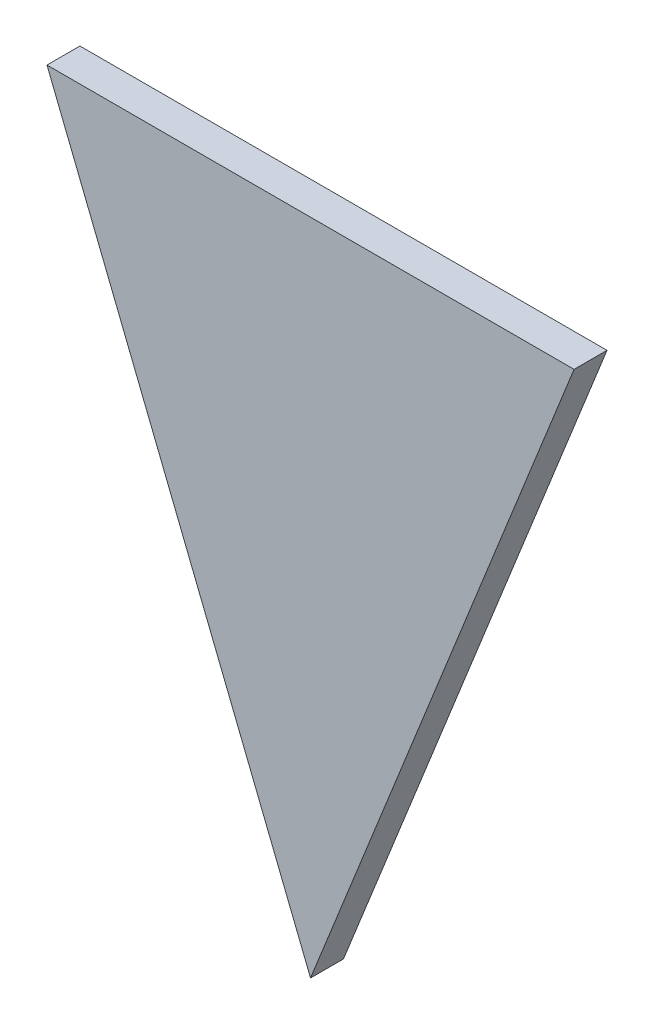
ISO-10303-21;
HEADER;
FILE_DESCRIPTION(('STEP AP214'),'2;1');
FILE_NAME('part.step','',(''),(''),'','','');
FILE_SCHEMA(('AUTOMOTIVE_DESIGN { 1 0 10303 214 1 1 1 1 }'));
ENDSEC;
DATA;
#1=APPLICATION_CONTEXT('core data for automotive mechanical design processes');
#2=APPLICATION_PROTOCOL_DEFINITION('international standard','automotive_design',2000,#1);
#3=PRODUCT_CONTEXT('',#1,'mechanical');
#4=PRODUCT('Part','Part','',(#3));
#5=PRODUCT_RELATED_PRODUCT_CATEGORY('part','',(#4));
#6=PRODUCT_DEFINITION_FORMATION('','',#4);
#7=PRODUCT_DEFINITION_CONTEXT('part definition',#1,'design');
#8=PRODUCT_DEFINITION('design','',#6,#7);
#9=PRODUCT_DEFINITION_SHAPE('','',#8);
#10=(LENGTH_UNIT() NAMED_UNIT(*) SI_UNIT(.MILLI.,.METRE.));
#11=(NAMED_UNIT(*) PLANE_ANGLE_UNIT() SI_UNIT($,.RADIAN.));
#12=(NAMED_UNIT(*) SI_UNIT($,.STERADIAN.) SOLID_ANGLE_UNIT());
#13=UNCERTAINTY_MEASURE_WITH_UNIT(LENGTH_MEASURE(1.E-05),#10,'distance_accuracy_value','');
#14=(GEOMETRIC_REPRESENTATION_CONTEXT(3) GLOBAL_UNCERTAINTY_ASSIGNED_CONTEXT((#13)) GLOBAL_UNIT_ASSIGNED_CONTEXT((#10,
#11,#12)) REPRESENTATION_CONTEXT('',''));
#15=CARTESIAN_POINT('',(0.,0.,0.));
#16=DIRECTION('',(0.,0.,1.));
#17=DIRECTION('',(1.,0.,0.));
#18=AXIS2_PLACEMENT_3D('',#15,#16,#17);
#19=CARTESIAN_POINT('',(0.,0.,0.));
#20=DIRECTION('',(0.,0.,1.));
#21=DIRECTION('',(1.,0.,0.));
#22=AXIS2_PLACEMENT_3D('',#19,#20,#21);
#23=PLANE('',#22);
#24=DIRECTION('',(-1.,0.,0.));
#25=VECTOR('',#24,1.);
#26=CARTESIAN_POINT('',(1.016,3.048,0.));
#27=LINE('',#26,#25);
#28=CARTESIAN_POINT('',(1.016,3.048,0.));
#29=VERTEX_POINT('',#28);
#30=CARTESIAN_POINT('',(-1.016,3.048,0.));
#31=VERTEX_POINT('',#30);
#32=EDGE_CURVE('E11',#29,#31,#27,.T.);
#33=ORIENTED_EDGE('',*,*,#32,.F.);
#34=DIRECTION('',(0.371390676354104,0.928476690885259,0.));
#35=VECTOR('',#34,1.);
#36=CARTESIAN_POINT('',(0.,0.508,0.));
#37=LINE('',#36,#35);
#38=CARTESIAN_POINT('',(0.,0.508,0.));
#39=VERTEX_POINT('',#38);
#40=EDGE_CURVE('E25',#39,#29,#37,.T.);
#41=ORIENTED_EDGE('',*,*,#40,.F.);
#42=DIRECTION('',(0.371390676354104,-0.928476690885259,0.));
#43=VECTOR('',#42,1.);
#44=CARTESIAN_POINT('',(-1.016,3.048,0.));
#45=LINE('',#44,#43);
#46=EDGE_CURVE('E82',#31,#39,#45,.T.);
#47=ORIENTED_EDGE('',*,*,#46,.F.);
#48=EDGE_LOOP('',(#33,#41,#47));
#49=FACE_BOUND('',#48,.T.);
#50=ADVANCED_FACE('F17',(#49),#23,.F.);
#51=CARTESIAN_POINT('',(-1.016,3.048,0.127));
#52=DIRECTION('',(0.928476690885259,0.371390676354104,0.));
#53=DIRECTION('',(-0.371390676354104,0.928476690885259,0.));
#54=AXIS2_PLACEMENT_3D('',#51,#52,#53);
#55=PLANE('',#54);
#56=ORIENTED_EDGE('',*,*,#46,.T.);
#57=DIRECTION('',(0.,0.,-1.));
#58=VECTOR('',#57,1.);
#59=CARTESIAN_POINT('',(0.,0.508,0.127));
#60=LINE('',#59,#58);
#61=CARTESIAN_POINT('',(0.,0.508,0.127));
#62=VERTEX_POINT('',#61);
#63=EDGE_CURVE('E78',#62,#39,#60,.T.);
#64=ORIENTED_EDGE('',*,*,#63,.F.);
#65=DIRECTION('',(0.371390676354104,-0.928476690885259,0.));
#66=VECTOR('',#65,1.);
#67=CARTESIAN_POINT('',(-1.016,3.048,0.127));
#68=LINE('',#67,#66);
#69=CARTESIAN_POINT('',(-1.016,3.048,0.127));
#70=VERTEX_POINT('',#69);
#71=EDGE_CURVE('E65',#70,#62,#68,.T.);
#72=ORIENTED_EDGE('',*,*,#71,.F.);
#73=DIRECTION('',(0.,0.,-1.));
#74=VECTOR('',#73,1.);
#75=CARTESIAN_POINT('',(-1.016,3.048,0.127));
#76=LINE('',#75,#74);
#77=EDGE_CURVE('E53',#70,#31,#76,.T.);
#78=ORIENTED_EDGE('',*,*,#77,.T.);
#79=EDGE_LOOP('',(#56,#64,#72,#78));
#80=FACE_BOUND('',#79,.T.);
#81=ADVANCED_FACE('F91',(#80),#55,.F.);
#82=CARTESIAN_POINT('',(1.016,3.048,0.127));
#83=DIRECTION('',(0.,-1.,0.));
#84=DIRECTION('',(0.,0.,-1.));
#85=AXIS2_PLACEMENT_3D('',#82,#83,#84);
#86=PLANE('',#85);
#87=ORIENTED_EDGE('',*,*,#32,.T.);
#88=ORIENTED_EDGE('',*,*,#77,.F.);
#89=DIRECTION('',(-1.,0.,0.));
#90=VECTOR('',#89,1.);
#91=CARTESIAN_POINT('',(1.016,3.048,0.127));
#92=LINE('',#91,#90);
#93=CARTESIAN_POINT('',(1.016,3.048,0.127));
#94=VERTEX_POINT('',#93);
#95=EDGE_CURVE('E48',#94,#70,#92,.T.);
#96=ORIENTED_EDGE('',*,*,#95,.F.);
#97=DIRECTION('',(0.,0.,-1.));
#98=VECTOR('',#97,1.);
#99=CARTESIAN_POINT('',(1.016,3.048,0.127));
#100=LINE('',#99,#98);
#101=EDGE_CURVE('E51',#94,#29,#100,.T.);
#102=ORIENTED_EDGE('',*,*,#101,.T.);
#103=EDGE_LOOP('',(#87,#88,#96,#102));
#104=FACE_BOUND('',#103,.T.);
#105=ADVANCED_FACE('F50',(#104),#86,.F.);
#106=CARTESIAN_POINT('',(0.,0.508,0.127));
#107=DIRECTION('',(-0.928476690885259,0.371390676354104,0.));
#108=DIRECTION('',(-0.371390676354104,-0.928476690885259,0.));
#109=AXIS2_PLACEMENT_3D('',#106,#107,#108);
#110=PLANE('',#109);
#111=ORIENTED_EDGE('',*,*,#40,.T.);
#112=ORIENTED_EDGE('',*,*,#101,.F.);
#113=DIRECTION('',(0.371390676354104,0.928476690885259,0.));
#114=VECTOR('',#113,1.);
#115=CARTESIAN_POINT('',(0.,0.508,0.127));
#116=LINE('',#115,#114);
#117=EDGE_CURVE('E62',#62,#94,#116,.T.);
#118=ORIENTED_EDGE('',*,*,#117,.F.);
#119=ORIENTED_EDGE('',*,*,#63,.T.);
#120=EDGE_LOOP('',(#111,#112,#118,#119));
#121=FACE_BOUND('',#120,.T.);
#122=ADVANCED_FACE('F60',(#121),#110,.F.);
#123=CARTESIAN_POINT('',(0.,0.,0.127));
#124=DIRECTION('',(0.,0.,1.));
#125=DIRECTION('',(1.,0.,0.));
#126=AXIS2_PLACEMENT_3D('',#123,#124,#125);
#127=PLANE('',#126);
#128=ORIENTED_EDGE('',*,*,#95,.T.);
#129=ORIENTED_EDGE('',*,*,#71,.T.);
#130=ORIENTED_EDGE('',*,*,#117,.T.);
#131=EDGE_LOOP('',(#128,#129,#130));
#132=FACE_BOUND('',#131,.T.);
#133=ADVANCED_FACE('F64',(#132),#127,.T.);
#134=CLOSED_SHELL('',(#50,#81,#105,#122,#133));
#135=MANIFOLD_SOLID_BREP('B1',#134);
#136=ADVANCED_BREP_SHAPE_REPRESENTATION('',(#18,#135),#14);
#137=SHAPE_DEFINITION_REPRESENTATION(#9,#136);
ENDSEC;
END-ISO-10303-21;
